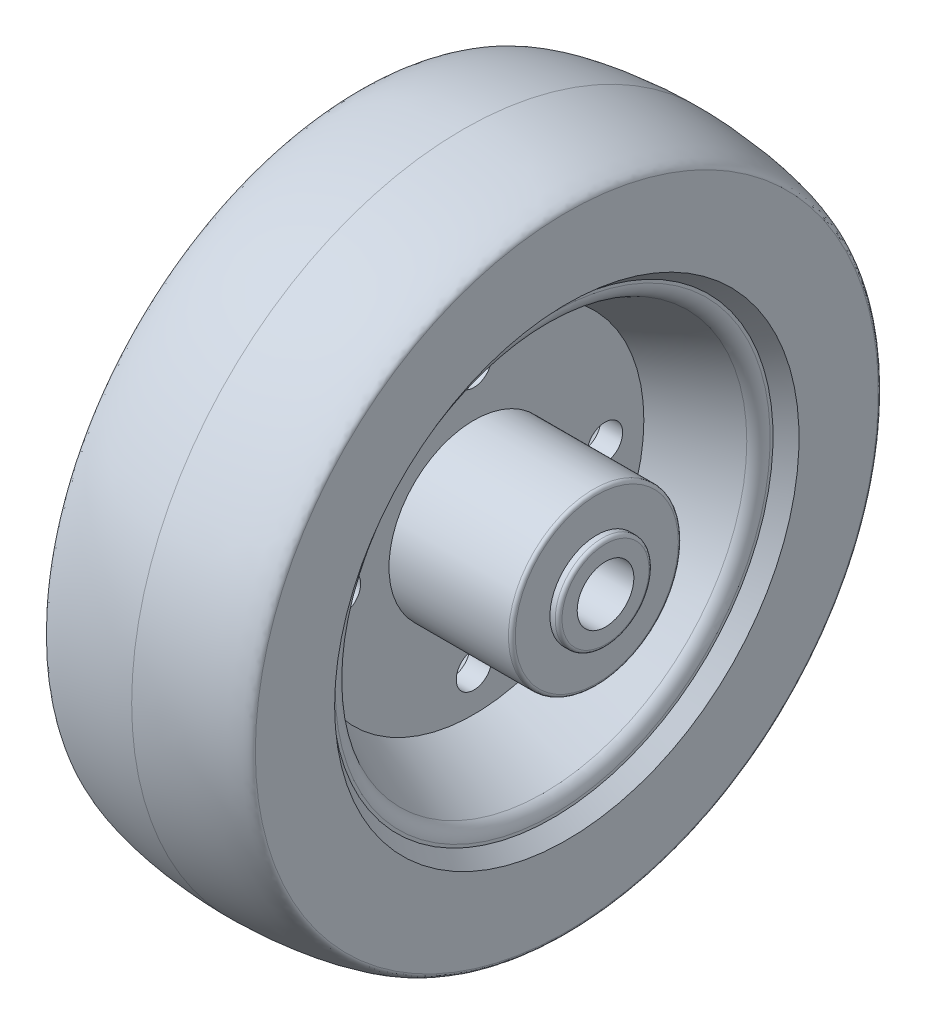
ISO-10303-21;
HEADER;
FILE_DESCRIPTION(('STEP AP214'),'2;1');
FILE_NAME('part.step','',(''),(''),'','','');
FILE_SCHEMA(('AUTOMOTIVE_DESIGN { 1 0 10303 214 1 1 1 1 }'));
ENDSEC;
DATA;
#1=APPLICATION_CONTEXT('core data for automotive mechanical design processes');
#2=APPLICATION_PROTOCOL_DEFINITION('international standard','automotive_design',2000,#1);
#3=PRODUCT_CONTEXT('',#1,'mechanical');
#4=PRODUCT('Part','Part','',(#3));
#5=PRODUCT_RELATED_PRODUCT_CATEGORY('part','',(#4));
#6=PRODUCT_DEFINITION_FORMATION('','',#4);
#7=PRODUCT_DEFINITION_CONTEXT('part definition',#1,'design');
#8=PRODUCT_DEFINITION('design','',#6,#7);
#9=PRODUCT_DEFINITION_SHAPE('','',#8);
#10=(LENGTH_UNIT() NAMED_UNIT(*) SI_UNIT(.MILLI.,.METRE.));
#11=(NAMED_UNIT(*) PLANE_ANGLE_UNIT() SI_UNIT($,.RADIAN.));
#12=(NAMED_UNIT(*) SI_UNIT($,.STERADIAN.) SOLID_ANGLE_UNIT());
#13=UNCERTAINTY_MEASURE_WITH_UNIT(LENGTH_MEASURE(1.E-05),#10,'distance_accuracy_value','');
#14=(GEOMETRIC_REPRESENTATION_CONTEXT(3) GLOBAL_UNCERTAINTY_ASSIGNED_CONTEXT((#13)) GLOBAL_UNIT_ASSIGNED_CONTEXT((#10,
#11,#12)) REPRESENTATION_CONTEXT('',''));
#15=CARTESIAN_POINT('',(0.,0.,0.));
#16=DIRECTION('',(0.,0.,1.));
#17=DIRECTION('',(1.,0.,0.));
#18=AXIS2_PLACEMENT_3D('',#15,#16,#17);
#19=CARTESIAN_POINT('',(29.9974,0.,0.));
#20=DIRECTION('',(1.,0.,0.));
#21=DIRECTION('',(0.,0.,-1.));
#22=AXIS2_PLACEMENT_3D('',#19,#20,#21);
#23=PLANE('',#22);
#24=CARTESIAN_POINT('',(29.9974,0.,0.));
#25=DIRECTION('',(1.,0.,0.));
#26=DIRECTION('',(0.,0.,-1.));
#27=AXIS2_PLACEMENT_3D('',#24,#25,#26);
#28=CIRCLE('',#27,18.288);
#29=CARTESIAN_POINT('',(29.9974,0.,-18.288));
#30=VERTEX_POINT('',#29);
#31=EDGE_CURVE('E245',#30,#30,#28,.T.);
#32=ORIENTED_EDGE('',*,*,#31,.T.);
#33=EDGE_LOOP('',(#32));
#34=FACE_BOUND('',#33,.T.);
#35=CARTESIAN_POINT('',(29.9974,0.,0.));
#36=DIRECTION('',(1.,0.,0.));
#37=DIRECTION('',(0.,0.,-1.));
#38=AXIS2_PLACEMENT_3D('',#35,#36,#37);
#39=CIRCLE('',#38,10.5156);
#40=CARTESIAN_POINT('',(29.9974,0.,-10.5156));
#41=VERTEX_POINT('',#40);
#42=EDGE_CURVE('E76',#41,#41,#39,.T.);
#43=ORIENTED_EDGE('',*,*,#42,.F.);
#44=EDGE_LOOP('',(#43));
#45=FACE_BOUND('',#44,.T.);
#46=ADVANCED_FACE('F31',(#34,#45),#23,.T.);
#47=CARTESIAN_POINT('',(2.4511,0.,0.));
#48=DIRECTION('',(1.,0.,0.));
#49=DIRECTION('',(0.,0.,-1.));
#50=AXIS2_PLACEMENT_3D('',#47,#48,#49);
#51=PLANE('',#50);
#52=CARTESIAN_POINT('',(2.4511,-4.1017958477087E-13,29.3687499999996));
#53=DIRECTION('',(1.,0.,0.));
#54=DIRECTION('',(0.,0.,-1.));
#55=AXIS2_PLACEMENT_3D('',#52,#53,#54);
#56=CIRCLE('',#55,3.96875);
#57=CARTESIAN_POINT('',(2.4511,-4.1017958477087E-13,25.3999999999996));
#58=VERTEX_POINT('',#57);
#59=EDGE_CURVE('E68',#58,#58,#56,.T.);
#60=ORIENTED_EDGE('',*,*,#59,.F.);
#61=EDGE_LOOP('',(#60));
#62=FACE_BOUND('',#61,.T.);
#63=CARTESIAN_POINT('',(2.4511,-29.36875,-8.27552438678232E-13));
#64=DIRECTION('',(1.,0.,0.));
#65=DIRECTION('',(0.,0.,-1.));
#66=AXIS2_PLACEMENT_3D('',#63,#64,#65);
#67=CIRCLE('',#66,3.96875);
#68=CARTESIAN_POINT('',(2.4511,-29.36875,-3.96875000000083));
#69=VERTEX_POINT('',#68);
#70=EDGE_CURVE('E58',#69,#69,#67,.T.);
#71=ORIENTED_EDGE('',*,*,#70,.F.);
#72=EDGE_LOOP('',(#71));
#73=FACE_BOUND('',#72,.T.);
#74=CARTESIAN_POINT('',(2.4511,4.13776219339116E-13,-29.3687500000004));
#75=DIRECTION('',(1.,0.,0.));
#76=DIRECTION('',(0.,0.,-1.));
#77=AXIS2_PLACEMENT_3D('',#74,#75,#76);
#78=CIRCLE('',#77,3.96874999999999);
#79=CARTESIAN_POINT('',(2.4511,4.13776219339116E-13,-33.3375000000004));
#80=VERTEX_POINT('',#79);
#81=EDGE_CURVE('E55',#80,#80,#78,.T.);
#82=ORIENTED_EDGE('',*,*,#81,.F.);
#83=EDGE_LOOP('',(#82));
#84=FACE_BOUND('',#83,.T.);
#85=CARTESIAN_POINT('',(2.4511,29.36875,0.));
#86=DIRECTION('',(1.,0.,0.));
#87=DIRECTION('',(0.,0.,-1.));
#88=AXIS2_PLACEMENT_3D('',#85,#86,#87);
#89=CIRCLE('',#88,3.96875);
#90=CARTESIAN_POINT('',(2.4511,29.36875,-3.96875));
#91=VERTEX_POINT('',#90);
#92=EDGE_CURVE('E52',#91,#91,#89,.T.);
#93=ORIENTED_EDGE('',*,*,#92,.F.);
#94=EDGE_LOOP('',(#93));
#95=FACE_BOUND('',#94,.T.);
#96=CARTESIAN_POINT('',(2.45110000000004,0.,0.));
#97=DIRECTION('',(-1.,0.,0.));
#98=DIRECTION('',(0.,0.,1.));
#99=AXIS2_PLACEMENT_3D('',#96,#97,#98);
#100=CIRCLE('',#99,38.1);
#101=CARTESIAN_POINT('',(2.45110000000004,0.,38.1));
#102=VERTEX_POINT('',#101);
#103=EDGE_CURVE('E99',#102,#102,#100,.T.);
#104=ORIENTED_EDGE('',*,*,#103,.F.);
#105=EDGE_LOOP('',(#104));
#106=FACE_BOUND('',#105,.T.);
#107=CARTESIAN_POINT('',(2.4511,0.,0.));
#108=DIRECTION('',(1.,0.,0.));
#109=DIRECTION('',(0.,0.,-1.));
#110=AXIS2_PLACEMENT_3D('',#107,#108,#109);
#111=CIRCLE('',#110,19.05);
#112=CARTESIAN_POINT('',(2.4511,0.,-19.05));
#113=VERTEX_POINT('',#112);
#114=EDGE_CURVE('E81',#113,#113,#111,.T.);
#115=ORIENTED_EDGE('',*,*,#114,.F.);
#116=EDGE_LOOP('',(#115));
#117=FACE_BOUND('',#116,.T.);
#118=ADVANCED_FACE('F142',(#62,#73,#84,#95,#106,#117),#51,.T.);
#119=CARTESIAN_POINT('',(-23.2791,0.,0.));
#120=DIRECTION('',(1.,0.,0.));
#121=DIRECTION('',(0.,0.,-1.));
#122=AXIS2_PLACEMENT_3D('',#119,#120,#121);
#123=PLANE('',#122);
#124=CARTESIAN_POINT('',(-23.2791,0.,0.));
#125=DIRECTION('',(-1.,0.,0.));
#126=DIRECTION('',(0.,0.,1.));
#127=AXIS2_PLACEMENT_3D('',#124,#125,#126);
#128=CIRCLE('',#127,69.85);
#129=CARTESIAN_POINT('',(-23.2791,0.,69.85));
#130=VERTEX_POINT('',#129);
#131=EDGE_CURVE('E234',#130,#130,#128,.T.);
#132=ORIENTED_EDGE('',*,*,#131,.T.);
#133=EDGE_LOOP('',(#132));
#134=FACE_BOUND('',#133,.T.);
#135=CARTESIAN_POINT('',(-23.2791000000001,0.,0.));
#136=DIRECTION('',(-1.,0.,0.));
#137=DIRECTION('',(0.,0.,1.));
#138=AXIS2_PLACEMENT_3D('',#135,#136,#137);
#139=CIRCLE('',#138,52.07);
#140=CARTESIAN_POINT('',(-23.2791000000001,0.,52.07));
#141=VERTEX_POINT('',#140);
#142=EDGE_CURVE('E96',#141,#141,#139,.T.);
#143=ORIENTED_EDGE('',*,*,#142,.F.);
#144=EDGE_LOOP('',(#143));
#145=FACE_BOUND('',#144,.T.);
#146=ADVANCED_FACE('F139',(#134,#145),#123,.F.);
#147=CARTESIAN_POINT('',(23.2791,0.,0.));
#148=DIRECTION('',(-1.,0.,0.));
#149=DIRECTION('',(0.,0.,1.));
#150=AXIS2_PLACEMENT_3D('',#147,#148,#149);
#151=PLANE('',#150);
#152=CARTESIAN_POINT('',(23.2791,0.,0.));
#153=DIRECTION('',(-1.,0.,0.));
#154=DIRECTION('',(0.,0.,1.));
#155=AXIS2_PLACEMENT_3D('',#152,#153,#154);
#156=CIRCLE('',#155,69.85);
#157=CARTESIAN_POINT('',(23.2791,0.,69.85));
#158=VERTEX_POINT('',#157);
#159=EDGE_CURVE('E114',#158,#158,#156,.T.);
#160=ORIENTED_EDGE('',*,*,#159,.F.);
#161=EDGE_LOOP('',(#160));
#162=FACE_BOUND('',#161,.T.);
#163=CARTESIAN_POINT('',(23.2791000000001,0.,0.));
#164=DIRECTION('',(-1.,0.,0.));
#165=DIRECTION('',(0.,0.,1.));
#166=AXIS2_PLACEMENT_3D('',#163,#164,#165);
#167=CIRCLE('',#166,52.07);
#168=CARTESIAN_POINT('',(23.2791000000001,0.,52.07));
#169=VERTEX_POINT('',#168);
#170=EDGE_CURVE('E111',#169,#169,#167,.T.);
#171=ORIENTED_EDGE('',*,*,#170,.T.);
#172=EDGE_LOOP('',(#171));
#173=FACE_BOUND('',#172,.T.);
#174=ADVANCED_FACE('F134',(#162,#173),#151,.F.);
#175=CARTESIAN_POINT('',(0.,74.295,0.));
#176=CARTESIAN_POINT('',(-10.5362476671072,74.295,0.));
#177=CARTESIAN_POINT('',(-23.2791,72.0679653618574,0.));
#178=CARTESIAN_POINT('',(-23.2791,69.85,0.));
#179=B_SPLINE_CURVE_WITH_KNOTS('',3,(#175,#176,#177,#178),.UNSPECIFIED.,.F.,.F.,(4,4),(0.,1.),.UNSPECIFIED.);
#180=CARTESIAN_POINT('',(-23.2791,0.,0.));
#181=DIRECTION('',(-1.,0.,0.));
#182=AXIS1_PLACEMENT('',#180,#181);
#183=SURFACE_OF_REVOLUTION('',#179,#182);
#184=ORIENTED_EDGE('',*,*,#131,.F.);
#185=EDGE_LOOP('',(#184));
#186=FACE_BOUND('',#185,.T.);
#187=CARTESIAN_POINT('',(0.,0.,0.));
#188=DIRECTION('',(-1.,0.,0.));
#189=DIRECTION('',(0.,0.,1.));
#190=AXIS2_PLACEMENT_3D('',#187,#188,#189);
#191=CIRCLE('',#190,74.295);
#192=CARTESIAN_POINT('',(0.,0.,74.295));
#193=VERTEX_POINT('',#192);
#194=EDGE_CURVE('E232',#193,#193,#191,.T.);
#195=ORIENTED_EDGE('',*,*,#194,.T.);
#196=EDGE_LOOP('',(#195));
#197=FACE_BOUND('',#196,.T.);
#198=ADVANCED_FACE('F132',(#186,#197),#183,.T.);
#199=CARTESIAN_POINT('',(23.2791,69.85,0.));
#200=CARTESIAN_POINT('',(23.2791,72.0679653618574,0.));
#201=CARTESIAN_POINT('',(10.5362476671072,74.295,0.));
#202=CARTESIAN_POINT('',(0.,74.295,0.));
#203=B_SPLINE_CURVE_WITH_KNOTS('',3,(#199,#200,#201,#202),.UNSPECIFIED.,.F.,.F.,(4,4),(0.,1.),.UNSPECIFIED.);
#204=CARTESIAN_POINT('',(-23.2791,0.,0.));
#205=DIRECTION('',(-1.,0.,0.));
#206=AXIS1_PLACEMENT('',#204,#205);
#207=SURFACE_OF_REVOLUTION('',#203,#206);
#208=ORIENTED_EDGE('',*,*,#194,.F.);
#209=EDGE_LOOP('',(#208));
#210=FACE_BOUND('',#209,.T.);
#211=ORIENTED_EDGE('',*,*,#159,.T.);
#212=EDGE_LOOP('',(#211));
#213=FACE_BOUND('',#212,.T.);
#214=ADVANCED_FACE('F127',(#210,#213),#207,.T.);
#215=CARTESIAN_POINT('',(23.2791000000001,0.,0.));
#216=DIRECTION('',(1.,0.,0.));
#217=DIRECTION('',(0.,0.,-1.));
#218=AXIS2_PLACEMENT_3D('',#215,#216,#217);
#219=CONICAL_SURFACE('',#218,52.07,0.696844561305953);
#220=CARTESIAN_POINT('',(20.1041,0.,0.));
#221=DIRECTION('',(-1.,0.,0.));
#222=DIRECTION('',(0.,0.,1.));
#223=AXIS2_PLACEMENT_3D('',#220,#221,#222);
#224=CIRCLE('',#223,49.4128152040177);
#225=CARTESIAN_POINT('',(20.1041,0.,49.4128152040177));
#226=VERTEX_POINT('',#225);
#227=EDGE_CURVE('E108',#226,#226,#224,.T.);
#228=ORIENTED_EDGE('',*,*,#227,.T.);
#229=EDGE_LOOP('',(#228));
#230=FACE_BOUND('',#229,.T.);
#231=ORIENTED_EDGE('',*,*,#170,.F.);
#232=EDGE_LOOP('',(#231));
#233=FACE_BOUND('',#232,.T.);
#234=ADVANCED_FACE('F131',(#230,#233),#219,.F.);
#235=CARTESIAN_POINT('',(20.1041,0.,-48.7631779977786));
#236=DIRECTION('',(1.,0.,0.));
#237=DIRECTION('',(0.,0.,-1.));
#238=AXIS2_PLACEMENT_3D('',#235,#236,#237);
#239=PLANE('',#238);
#240=CARTESIAN_POINT('',(20.1041,0.,0.));
#241=DIRECTION('',(-1.,0.,0.));
#242=DIRECTION('',(0.,0.,1.));
#243=AXIS2_PLACEMENT_3D('',#240,#241,#242);
#244=CIRCLE('',#243,48.7631779977786);
#245=CARTESIAN_POINT('',(20.1041,0.,48.7631779977786));
#246=VERTEX_POINT('',#245);
#247=EDGE_CURVE('E105',#246,#246,#244,.T.);
#248=ORIENTED_EDGE('',*,*,#247,.T.);
#249=EDGE_LOOP('',(#248));
#250=FACE_BOUND('',#249,.T.);
#251=ORIENTED_EDGE('',*,*,#227,.F.);
#252=EDGE_LOOP('',(#251));
#253=FACE_BOUND('',#252,.T.);
#254=ADVANCED_FACE('F213',(#250,#253),#239,.T.);
#255=CARTESIAN_POINT('',(16.5481,0.,0.));
#256=DIRECTION('',(-1.,0.,0.));
#257=DIRECTION('',(0.,0.,1.));
#258=AXIS2_PLACEMENT_3D('',#255,#256,#257);
#259=TOROIDAL_SURFACE('',#258,48.7631779977786,3.556);
#260=CARTESIAN_POINT('',(18.0789071116974,0.,0.));
#261=DIRECTION('',(-1.,0.,0.));
#262=DIRECTION('',(0.,0.,1.));
#263=AXIS2_PLACEMENT_3D('',#260,#261,#262);
#264=CIRCLE('',#263,45.5535416341422);
#265=CARTESIAN_POINT('',(18.0789071116974,0.,45.5535416341422));
#266=VERTEX_POINT('',#265);
#267=EDGE_CURVE('E102',#266,#266,#264,.T.);
#268=ORIENTED_EDGE('',*,*,#267,.T.);
#269=EDGE_LOOP('',(#268));
#270=FACE_BOUND('',#269,.T.);
#271=ORIENTED_EDGE('',*,*,#247,.F.);
#272=EDGE_LOOP('',(#271));
#273=FACE_BOUND('',#272,.T.);
#274=ADVANCED_FACE('F209',(#270,#273),#259,.T.);
#275=CARTESIAN_POINT('',(18.0789071116974,0.,0.));
#276=DIRECTION('',(1.,0.,0.));
#277=DIRECTION('',(0.,0.,-1.));
#278=AXIS2_PLACEMENT_3D('',#275,#276,#277);
#279=CONICAL_SURFACE('',#278,45.5535416341422,0.445030809914133);
#280=ORIENTED_EDGE('',*,*,#103,.T.);
#281=EDGE_LOOP('',(#280));
#282=FACE_BOUND('',#281,.T.);
#283=ORIENTED_EDGE('',*,*,#267,.F.);
#284=EDGE_LOOP('',(#283));
#285=FACE_BOUND('',#284,.T.);
#286=ADVANCED_FACE('F204',(#282,#285),#279,.F.);
#287=CARTESIAN_POINT('',(-23.2791000000001,0.,0.));
#288=DIRECTION('',(-1.,0.,0.));
#289=DIRECTION('',(0.,0.,-1.));
#290=AXIS2_PLACEMENT_3D('',#287,#288,#289);
#291=CONICAL_SURFACE('',#290,52.07,0.696844561305953);
#292=CARTESIAN_POINT('',(-20.1041,0.,0.));
#293=DIRECTION('',(-1.,0.,0.));
#294=DIRECTION('',(0.,0.,1.));
#295=AXIS2_PLACEMENT_3D('',#292,#293,#294);
#296=CIRCLE('',#295,49.4128152040177);
#297=CARTESIAN_POINT('',(-20.1041,0.,49.4128152040177));
#298=VERTEX_POINT('',#297);
#299=EDGE_CURVE('E93',#298,#298,#296,.T.);
#300=ORIENTED_EDGE('',*,*,#299,.F.);
#301=EDGE_LOOP('',(#300));
#302=FACE_BOUND('',#301,.T.);
#303=ORIENTED_EDGE('',*,*,#142,.T.);
#304=EDGE_LOOP('',(#303));
#305=FACE_BOUND('',#304,.T.);
#306=ADVANCED_FACE('F201',(#302,#305),#291,.F.);
#307=CARTESIAN_POINT('',(-20.1041,0.,-48.7631779977786));
#308=DIRECTION('',(-1.,0.,0.));
#309=DIRECTION('',(0.,0.,-1.));
#310=AXIS2_PLACEMENT_3D('',#307,#308,#309);
#311=PLANE('',#310);
#312=CARTESIAN_POINT('',(-20.1041,0.,0.));
#313=DIRECTION('',(-1.,0.,0.));
#314=DIRECTION('',(0.,0.,1.));
#315=AXIS2_PLACEMENT_3D('',#312,#313,#314);
#316=CIRCLE('',#315,48.7631779977786);
#317=CARTESIAN_POINT('',(-20.1041,0.,48.7631779977786));
#318=VERTEX_POINT('',#317);
#319=EDGE_CURVE('E90',#318,#318,#316,.T.);
#320=ORIENTED_EDGE('',*,*,#319,.F.);
#321=EDGE_LOOP('',(#320));
#322=FACE_BOUND('',#321,.T.);
#323=ORIENTED_EDGE('',*,*,#299,.T.);
#324=EDGE_LOOP('',(#323));
#325=FACE_BOUND('',#324,.T.);
#326=ADVANCED_FACE('F197',(#322,#325),#311,.T.);
#327=CARTESIAN_POINT('',(-16.5481,0.,0.));
#328=DIRECTION('',(1.,0.,0.));
#329=DIRECTION('',(0.,0.,1.));
#330=AXIS2_PLACEMENT_3D('',#327,#328,#329);
#331=TOROIDAL_SURFACE('',#330,48.7631779977786,3.556);
#332=CARTESIAN_POINT('',(-18.0789071116974,0.,0.));
#333=DIRECTION('',(-1.,0.,0.));
#334=DIRECTION('',(0.,0.,1.));
#335=AXIS2_PLACEMENT_3D('',#332,#333,#334);
#336=CIRCLE('',#335,45.5535416341422);
#337=CARTESIAN_POINT('',(-18.0789071116974,0.,45.5535416341422));
#338=VERTEX_POINT('',#337);
#339=EDGE_CURVE('E87',#338,#338,#336,.T.);
#340=ORIENTED_EDGE('',*,*,#339,.F.);
#341=EDGE_LOOP('',(#340));
#342=FACE_BOUND('',#341,.T.);
#343=ORIENTED_EDGE('',*,*,#319,.T.);
#344=EDGE_LOOP('',(#343));
#345=FACE_BOUND('',#344,.T.);
#346=ADVANCED_FACE('F193',(#342,#345),#331,.T.);
#347=CARTESIAN_POINT('',(-18.0789071116974,0.,0.));
#348=DIRECTION('',(-1.,0.,0.));
#349=DIRECTION('',(0.,0.,-1.));
#350=AXIS2_PLACEMENT_3D('',#347,#348,#349);
#351=CONICAL_SURFACE('',#350,45.5535416341422,0.445030809914133);
#352=CARTESIAN_POINT('',(-2.45110000000004,0.,0.));
#353=DIRECTION('',(-1.,0.,0.));
#354=DIRECTION('',(0.,0.,1.));
#355=AXIS2_PLACEMENT_3D('',#352,#353,#354);
#356=CIRCLE('',#355,38.1);
#357=CARTESIAN_POINT('',(-2.45110000000004,0.,38.1));
#358=VERTEX_POINT('',#357);
#359=EDGE_CURVE('E84',#358,#358,#356,.T.);
#360=ORIENTED_EDGE('',*,*,#359,.F.);
#361=EDGE_LOOP('',(#360));
#362=FACE_BOUND('',#361,.T.);
#363=ORIENTED_EDGE('',*,*,#339,.T.);
#364=EDGE_LOOP('',(#363));
#365=FACE_BOUND('',#364,.T.);
#366=ADVANCED_FACE('F189',(#362,#365),#351,.F.);
#367=CARTESIAN_POINT('',(-2.4511,0.,0.));
#368=DIRECTION('',(-1.,0.,0.));
#369=DIRECTION('',(0.,0.,-1.));
#370=AXIS2_PLACEMENT_3D('',#367,#368,#369);
#371=PLANE('',#370);
#372=CARTESIAN_POINT('',(-2.4511,-4.1017958477087E-13,29.3687499999996));
#373=DIRECTION('',(-1.,0.,0.));
#374=DIRECTION('',(0.,0.,1.));
#375=AXIS2_PLACEMENT_3D('',#372,#373,#374);
#376=CIRCLE('',#375,3.96875);
#377=CARTESIAN_POINT('',(-2.4511,-4.1017958477087E-13,33.3374999999996));
#378=VERTEX_POINT('',#377);
#379=EDGE_CURVE('E35',#378,#378,#376,.T.);
#380=ORIENTED_EDGE('',*,*,#379,.F.);
#381=EDGE_LOOP('',(#380));
#382=FACE_BOUND('',#381,.T.);
#383=CARTESIAN_POINT('',(-2.4511,-29.36875,-8.27552438678232E-13));
#384=DIRECTION('',(-1.,0.,0.));
#385=DIRECTION('',(0.,0.,1.));
#386=AXIS2_PLACEMENT_3D('',#383,#384,#385);
#387=CIRCLE('',#386,3.96875);
#388=CARTESIAN_POINT('',(-2.4511,-29.36875,3.96874999999917));
#389=VERTEX_POINT('',#388);
#390=EDGE_CURVE('E56',#389,#389,#387,.T.);
#391=ORIENTED_EDGE('',*,*,#390,.F.);
#392=EDGE_LOOP('',(#391));
#393=FACE_BOUND('',#392,.T.);
#394=CARTESIAN_POINT('',(-2.4511,4.13776219339116E-13,-29.3687500000004));
#395=DIRECTION('',(-1.,0.,0.));
#396=DIRECTION('',(0.,0.,1.));
#397=AXIS2_PLACEMENT_3D('',#394,#395,#396);
#398=CIRCLE('',#397,3.96874999999999);
#399=CARTESIAN_POINT('',(-2.4511,4.13776219339116E-13,-25.4000000000004));
#400=VERTEX_POINT('',#399);
#401=EDGE_CURVE('E53',#400,#400,#398,.T.);
#402=ORIENTED_EDGE('',*,*,#401,.F.);
#403=EDGE_LOOP('',(#402));
#404=FACE_BOUND('',#403,.T.);
#405=CARTESIAN_POINT('',(-2.4511,29.36875,0.));
#406=DIRECTION('',(-1.,0.,0.));
#407=DIRECTION('',(0.,0.,1.));
#408=AXIS2_PLACEMENT_3D('',#405,#406,#407);
#409=CIRCLE('',#408,3.96875);
#410=CARTESIAN_POINT('',(-2.4511,29.36875,3.96875));
#411=VERTEX_POINT('',#410);
#412=EDGE_CURVE('E48',#411,#411,#409,.T.);
#413=ORIENTED_EDGE('',*,*,#412,.F.);
#414=EDGE_LOOP('',(#413));
#415=FACE_BOUND('',#414,.T.);
#416=CARTESIAN_POINT('',(-2.4511,0.,0.));
#417=DIRECTION('',(-1.,0.,0.));
#418=DIRECTION('',(0.,0.,1.));
#419=AXIS2_PLACEMENT_3D('',#416,#417,#418);
#420=CIRCLE('',#419,19.05);
#421=CARTESIAN_POINT('',(-2.4511,0.,19.05));
#422=VERTEX_POINT('',#421);
#423=EDGE_CURVE('E250',#422,#422,#420,.T.);
#424=ORIENTED_EDGE('',*,*,#423,.F.);
#425=EDGE_LOOP('',(#424));
#426=FACE_BOUND('',#425,.T.);
#427=ORIENTED_EDGE('',*,*,#359,.T.);
#428=EDGE_LOOP('',(#427));
#429=FACE_BOUND('',#428,.T.);
#430=ADVANCED_FACE('F185',(#382,#393,#404,#415,#426,#429),#371,.T.);
#431=CARTESIAN_POINT('',(29.9974,0.,0.));
#432=DIRECTION('',(-1.,0.,0.));
#433=DIRECTION('',(0.,0.,1.));
#434=AXIS2_PLACEMENT_3D('',#431,#432,#433);
#435=CYLINDRICAL_SURFACE('',#434,19.05);
#436=CARTESIAN_POINT('',(29.2354,0.,0.));
#437=DIRECTION('',(1.,0.,0.));
#438=DIRECTION('',(0.,0.,-1.));
#439=AXIS2_PLACEMENT_3D('',#436,#437,#438);
#440=CIRCLE('',#439,19.05);
#441=CARTESIAN_POINT('',(29.2354,0.,-19.05));
#442=VERTEX_POINT('',#441);
#443=EDGE_CURVE('E247',#442,#442,#440,.F.);
#444=ORIENTED_EDGE('',*,*,#443,.T.);
#445=EDGE_LOOP('',(#444));
#446=FACE_BOUND('',#445,.T.);
#447=ORIENTED_EDGE('',*,*,#114,.T.);
#448=EDGE_LOOP('',(#447));
#449=FACE_BOUND('',#448,.T.);
#450=ADVANCED_FACE('F182',(#446,#449),#435,.T.);
#451=CARTESIAN_POINT('',(31.9532,0.,0.));
#452=DIRECTION('',(-1.,0.,0.));
#453=DIRECTION('',(0.,0.,1.));
#454=AXIS2_PLACEMENT_3D('',#451,#452,#453);
#455=CYLINDRICAL_SURFACE('',#454,10.5156);
#456=CARTESIAN_POINT('',(31.1912,0.,0.));
#457=DIRECTION('',(1.,0.,0.));
#458=DIRECTION('',(0.,0.,-1.));
#459=AXIS2_PLACEMENT_3D('',#456,#457,#458);
#460=CIRCLE('',#459,10.5156);
#461=CARTESIAN_POINT('',(31.1912,0.,-10.5156));
#462=VERTEX_POINT('',#461);
#463=EDGE_CURVE('E242',#462,#462,#460,.F.);
#464=ORIENTED_EDGE('',*,*,#463,.T.);
#465=EDGE_LOOP('',(#464));
#466=FACE_BOUND('',#465,.T.);
#467=ORIENTED_EDGE('',*,*,#42,.T.);
#468=EDGE_LOOP('',(#467));
#469=FACE_BOUND('',#468,.T.);
#470=ADVANCED_FACE('F180',(#466,#469),#455,.T.);
#471=CARTESIAN_POINT('',(31.9532,0.,0.));
#472=DIRECTION('',(1.,0.,0.));
#473=DIRECTION('',(0.,0.,-1.));
#474=AXIS2_PLACEMENT_3D('',#471,#472,#473);
#475=PLANE('',#474);
#476=CARTESIAN_POINT('',(31.9532,0.,0.));
#477=DIRECTION('',(-1.,0.,0.));
#478=DIRECTION('',(0.,0.,1.));
#479=AXIS2_PLACEMENT_3D('',#476,#477,#478);
#480=CIRCLE('',#479,6.35);
#481=CARTESIAN_POINT('',(31.9532,0.,6.35));
#482=VERTEX_POINT('',#481);
#483=EDGE_CURVE('E73',#482,#482,#480,.T.);
#484=ORIENTED_EDGE('',*,*,#483,.T.);
#485=EDGE_LOOP('',(#484));
#486=FACE_BOUND('',#485,.T.);
#487=CARTESIAN_POINT('',(31.9532,0.,0.));
#488=DIRECTION('',(1.,0.,0.));
#489=DIRECTION('',(0.,0.,-1.));
#490=AXIS2_PLACEMENT_3D('',#487,#488,#489);
#491=CIRCLE('',#490,9.7536);
#492=CARTESIAN_POINT('',(31.9532,0.,-9.7536));
#493=VERTEX_POINT('',#492);
#494=EDGE_CURVE('E239',#493,#493,#491,.T.);
#495=ORIENTED_EDGE('',*,*,#494,.T.);
#496=EDGE_LOOP('',(#495));
#497=FACE_BOUND('',#496,.T.);
#498=ADVANCED_FACE('F148',(#486,#497),#475,.T.);
#499=CARTESIAN_POINT('',(31.1912,0.,0.));
#500=DIRECTION('',(1.,0.,0.));
#501=DIRECTION('',(0.,0.,-1.));
#502=AXIS2_PLACEMENT_3D('',#499,#500,#501);
#503=TOROIDAL_SURFACE('',#502,9.7536,0.762);
#504=ORIENTED_EDGE('',*,*,#463,.F.);
#505=EDGE_LOOP('',(#504));
#506=FACE_BOUND('',#505,.T.);
#507=ORIENTED_EDGE('',*,*,#494,.F.);
#508=EDGE_LOOP('',(#507));
#509=FACE_BOUND('',#508,.T.);
#510=ADVANCED_FACE('F144',(#506,#509),#503,.T.);
#511=CARTESIAN_POINT('',(29.2354,0.,0.));
#512=DIRECTION('',(1.,0.,0.));
#513=DIRECTION('',(0.,0.,-1.));
#514=AXIS2_PLACEMENT_3D('',#511,#512,#513);
#515=TOROIDAL_SURFACE('',#514,18.288,0.762);
#516=ORIENTED_EDGE('',*,*,#443,.F.);
#517=EDGE_LOOP('',(#516));
#518=FACE_BOUND('',#517,.T.);
#519=ORIENTED_EDGE('',*,*,#31,.F.);
#520=EDGE_LOOP('',(#519));
#521=FACE_BOUND('',#520,.T.);
#522=ADVANCED_FACE('F147',(#518,#521),#515,.T.);
#523=CARTESIAN_POINT('',(-29.9974,0.,0.));
#524=DIRECTION('',(1.,0.,0.));
#525=DIRECTION('',(0.,0.,-1.));
#526=AXIS2_PLACEMENT_3D('',#523,#524,#525);
#527=CYLINDRICAL_SURFACE('',#526,19.05);
#528=CARTESIAN_POINT('',(-29.2354,0.,0.));
#529=DIRECTION('',(-1.,0.,0.));
#530=DIRECTION('',(0.,0.,1.));
#531=AXIS2_PLACEMENT_3D('',#528,#529,#530);
#532=CIRCLE('',#531,19.05);
#533=CARTESIAN_POINT('',(-29.2354,0.,19.05));
#534=VERTEX_POINT('',#533);
#535=EDGE_CURVE('E39',#534,#534,#532,.F.);
#536=ORIENTED_EDGE('',*,*,#535,.T.);
#537=EDGE_LOOP('',(#536));
#538=FACE_BOUND('',#537,.T.);
#539=ORIENTED_EDGE('',*,*,#423,.T.);
#540=EDGE_LOOP('',(#539));
#541=FACE_BOUND('',#540,.T.);
#542=ADVANCED_FACE('F151',(#538,#541),#527,.T.);
#543=CARTESIAN_POINT('',(-29.9974,0.,0.));
#544=DIRECTION('',(-1.,0.,0.));
#545=DIRECTION('',(0.,0.,-1.));
#546=AXIS2_PLACEMENT_3D('',#543,#544,#545);
#547=PLANE('',#546);
#548=CARTESIAN_POINT('',(-29.9974,0.,0.));
#549=DIRECTION('',(-1.,0.,0.));
#550=DIRECTION('',(0.,0.,1.));
#551=AXIS2_PLACEMENT_3D('',#548,#549,#550);
#552=CIRCLE('',#551,18.288);
#553=CARTESIAN_POINT('',(-29.9974,0.,18.288));
#554=VERTEX_POINT('',#553);
#555=EDGE_CURVE('E10',#554,#554,#552,.T.);
#556=ORIENTED_EDGE('',*,*,#555,.T.);
#557=EDGE_LOOP('',(#556));
#558=FACE_BOUND('',#557,.T.);
#559=CARTESIAN_POINT('',(-29.9974,0.,0.));
#560=DIRECTION('',(-1.,0.,0.));
#561=DIRECTION('',(0.,0.,1.));
#562=AXIS2_PLACEMENT_3D('',#559,#560,#561);
#563=CIRCLE('',#562,10.5156);
#564=CARTESIAN_POINT('',(-29.9974,0.,10.5156));
#565=VERTEX_POINT('',#564);
#566=EDGE_CURVE('E253',#565,#565,#563,.T.);
#567=ORIENTED_EDGE('',*,*,#566,.F.);
#568=EDGE_LOOP('',(#567));
#569=FACE_BOUND('',#568,.T.);
#570=ADVANCED_FACE('F264',(#558,#569),#547,.T.);
#571=CARTESIAN_POINT('',(-31.9532,0.,0.));
#572=DIRECTION('',(1.,0.,0.));
#573=DIRECTION('',(0.,0.,-1.));
#574=AXIS2_PLACEMENT_3D('',#571,#572,#573);
#575=CYLINDRICAL_SURFACE('',#574,10.5156);
#576=CARTESIAN_POINT('',(-31.1912,0.,0.));
#577=DIRECTION('',(-1.,0.,0.));
#578=DIRECTION('',(0.,0.,1.));
#579=AXIS2_PLACEMENT_3D('',#576,#577,#578);
#580=CIRCLE('',#579,10.5156);
#581=CARTESIAN_POINT('',(-31.1912,0.,10.5156));
#582=VERTEX_POINT('',#581);
#583=EDGE_CURVE('E256',#582,#582,#580,.F.);
#584=ORIENTED_EDGE('',*,*,#583,.T.);
#585=EDGE_LOOP('',(#584));
#586=FACE_BOUND('',#585,.T.);
#587=ORIENTED_EDGE('',*,*,#566,.T.);
#588=EDGE_LOOP('',(#587));
#589=FACE_BOUND('',#588,.T.);
#590=ADVANCED_FACE('F163',(#586,#589),#575,.T.);
#591=CARTESIAN_POINT('',(-31.9532,0.,0.));
#592=DIRECTION('',(-1.,0.,0.));
#593=DIRECTION('',(0.,0.,-1.));
#594=AXIS2_PLACEMENT_3D('',#591,#592,#593);
#595=PLANE('',#594);
#596=CARTESIAN_POINT('',(-31.9532,0.,0.));
#597=DIRECTION('',(-1.,0.,0.));
#598=DIRECTION('',(0.,0.,1.));
#599=AXIS2_PLACEMENT_3D('',#596,#597,#598);
#600=CIRCLE('',#599,6.35);
#601=CARTESIAN_POINT('',(-31.9532,0.,6.35));
#602=VERTEX_POINT('',#601);
#603=EDGE_CURVE('E51',#602,#602,#600,.T.);
#604=ORIENTED_EDGE('',*,*,#603,.F.);
#605=EDGE_LOOP('',(#604));
#606=FACE_BOUND('',#605,.T.);
#607=CARTESIAN_POINT('',(-31.9532,0.,0.));
#608=DIRECTION('',(-1.,0.,0.));
#609=DIRECTION('',(0.,0.,1.));
#610=AXIS2_PLACEMENT_3D('',#607,#608,#609);
#611=CIRCLE('',#610,9.7536);
#612=CARTESIAN_POINT('',(-31.9532,0.,9.7536));
#613=VERTEX_POINT('',#612);
#614=EDGE_CURVE('E44',#613,#613,#611,.T.);
#615=ORIENTED_EDGE('',*,*,#614,.T.);
#616=EDGE_LOOP('',(#615));
#617=FACE_BOUND('',#616,.T.);
#618=ADVANCED_FACE('F155',(#606,#617),#595,.T.);
#619=CARTESIAN_POINT('',(-31.1912,0.,0.));
#620=DIRECTION('',(-1.,0.,0.));
#621=DIRECTION('',(0.,0.,1.));
#622=AXIS2_PLACEMENT_3D('',#619,#620,#621);
#623=TOROIDAL_SURFACE('',#622,9.7536,0.762);
#624=ORIENTED_EDGE('',*,*,#614,.F.);
#625=EDGE_LOOP('',(#624));
#626=FACE_BOUND('',#625,.T.);
#627=ORIENTED_EDGE('',*,*,#583,.F.);
#628=EDGE_LOOP('',(#627));
#629=FACE_BOUND('',#628,.T.);
#630=ADVANCED_FACE('F153',(#626,#629),#623,.T.);
#631=CARTESIAN_POINT('',(-29.2354,0.,0.));
#632=DIRECTION('',(-1.,0.,0.));
#633=DIRECTION('',(0.,0.,1.));
#634=AXIS2_PLACEMENT_3D('',#631,#632,#633);
#635=TOROIDAL_SURFACE('',#634,18.288,0.762);
#636=ORIENTED_EDGE('',*,*,#555,.F.);
#637=EDGE_LOOP('',(#636));
#638=FACE_BOUND('',#637,.T.);
#639=ORIENTED_EDGE('',*,*,#535,.F.);
#640=EDGE_LOOP('',(#639));
#641=FACE_BOUND('',#640,.T.);
#642=ADVANCED_FACE('F33',(#638,#641),#635,.T.);
#643=CARTESIAN_POINT('',(31.9532,0.,0.));
#644=DIRECTION('',(-1.,0.,0.));
#645=DIRECTION('',(0.,0.,1.));
#646=AXIS2_PLACEMENT_3D('',#643,#644,#645);
#647=CYLINDRICAL_SURFACE('',#646,6.35);
#648=ORIENTED_EDGE('',*,*,#483,.F.);
#649=EDGE_LOOP('',(#648));
#650=FACE_BOUND('',#649,.T.);
#651=ORIENTED_EDGE('',*,*,#603,.T.);
#652=EDGE_LOOP('',(#651));
#653=FACE_BOUND('',#652,.T.);
#654=ADVANCED_FACE('F161',(#650,#653),#647,.F.);
#655=CARTESIAN_POINT('',(-31.9532,29.36875,0.));
#656=DIRECTION('',(1.,0.,0.));
#657=DIRECTION('',(0.,0.,-1.));
#658=AXIS2_PLACEMENT_3D('',#655,#656,#657);
#659=CYLINDRICAL_SURFACE('',#658,3.96875);
#660=ORIENTED_EDGE('',*,*,#412,.T.);
#661=EDGE_LOOP('',(#660));
#662=FACE_BOUND('',#661,.T.);
#663=ORIENTED_EDGE('',*,*,#92,.T.);
#664=EDGE_LOOP('',(#663));
#665=FACE_BOUND('',#664,.T.);
#666=ADVANCED_FACE('F288',(#662,#665),#659,.F.);
#667=CARTESIAN_POINT('',(-31.9532,4.13776219339116E-13,-29.3687500000004));
#668=DIRECTION('',(1.,0.,0.));
#669=DIRECTION('',(0.,0.,-1.));
#670=AXIS2_PLACEMENT_3D('',#667,#668,#669);
#671=CYLINDRICAL_SURFACE('',#670,3.96874999999999);
#672=ORIENTED_EDGE('',*,*,#401,.T.);
#673=EDGE_LOOP('',(#672));
#674=FACE_BOUND('',#673,.T.);
#675=ORIENTED_EDGE('',*,*,#81,.T.);
#676=EDGE_LOOP('',(#675));
#677=FACE_BOUND('',#676,.T.);
#678=ADVANCED_FACE('F294',(#674,#677),#671,.F.);
#679=CARTESIAN_POINT('',(-31.9532,-29.36875,-8.27552438678232E-13));
#680=DIRECTION('',(1.,0.,0.));
#681=DIRECTION('',(0.,0.,-1.));
#682=AXIS2_PLACEMENT_3D('',#679,#680,#681);
#683=CYLINDRICAL_SURFACE('',#682,3.96875);
#684=ORIENTED_EDGE('',*,*,#390,.T.);
#685=EDGE_LOOP('',(#684));
#686=FACE_BOUND('',#685,.T.);
#687=ORIENTED_EDGE('',*,*,#70,.T.);
#688=EDGE_LOOP('',(#687));
#689=FACE_BOUND('',#688,.T.);
#690=ADVANCED_FACE('F300',(#686,#689),#683,.F.);
#691=CARTESIAN_POINT('',(-31.9532,-4.1017958477087E-13,29.3687499999996));
#692=DIRECTION('',(1.,0.,0.));
#693=DIRECTION('',(0.,0.,-1.));
#694=AXIS2_PLACEMENT_3D('',#691,#692,#693);
#695=CYLINDRICAL_SURFACE('',#694,3.96875);
#696=ORIENTED_EDGE('',*,*,#379,.T.);
#697=EDGE_LOOP('',(#696));
#698=FACE_BOUND('',#697,.T.);
#699=ORIENTED_EDGE('',*,*,#59,.T.);
#700=EDGE_LOOP('',(#699));
#701=FACE_BOUND('',#700,.T.);
#702=ADVANCED_FACE('F304',(#698,#701),#695,.F.);
#703=CLOSED_SHELL('',(#46,#118,#146,#174,#198,#214,#234,#254,#274,#286,#306,#326,#346,#366,#430,
#450,#470,#498,#510,#522,#542,#570,#590,#618,#630,#642,#654,#666,#678,#690,#702));
#704=MANIFOLD_SOLID_BREP('B2',#703);
#705=ADVANCED_BREP_SHAPE_REPRESENTATION('',(#18,#704),#14);
#706=SHAPE_DEFINITION_REPRESENTATION(#9,#705);
ENDSEC;
END-ISO-10303-21;
